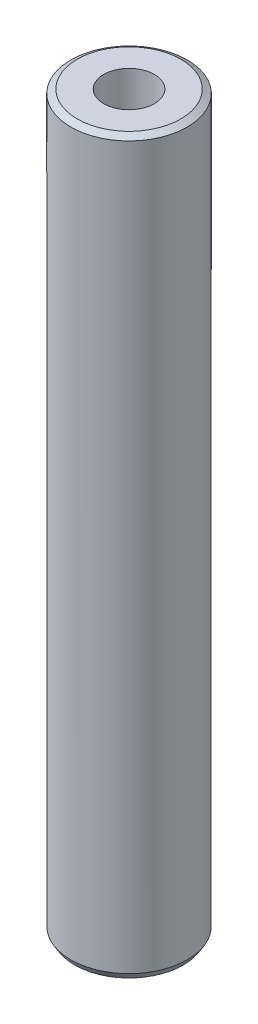
ISO-10303-21;
HEADER;
FILE_DESCRIPTION(('STEP AP214'),'2;1');
FILE_NAME('part.step','',(''),(''),'','','');
FILE_SCHEMA(('AUTOMOTIVE_DESIGN { 1 0 10303 214 1 1 1 1 }'));
ENDSEC;
DATA;
#1=APPLICATION_CONTEXT('core data for automotive mechanical design processes');
#2=APPLICATION_PROTOCOL_DEFINITION('international standard','automotive_design',2000,#1);
#3=PRODUCT_CONTEXT('',#1,'mechanical');
#4=PRODUCT('Part','Part','',(#3));
#5=PRODUCT_RELATED_PRODUCT_CATEGORY('part','',(#4));
#6=PRODUCT_DEFINITION_FORMATION('','',#4);
#7=PRODUCT_DEFINITION_CONTEXT('part definition',#1,'design');
#8=PRODUCT_DEFINITION('design','',#6,#7);
#9=PRODUCT_DEFINITION_SHAPE('','',#8);
#10=(LENGTH_UNIT() NAMED_UNIT(*) SI_UNIT(.MILLI.,.METRE.));
#11=(NAMED_UNIT(*) PLANE_ANGLE_UNIT() SI_UNIT($,.RADIAN.));
#12=(NAMED_UNIT(*) SI_UNIT($,.STERADIAN.) SOLID_ANGLE_UNIT());
#13=UNCERTAINTY_MEASURE_WITH_UNIT(LENGTH_MEASURE(1.E-05),#10,'distance_accuracy_value','');
#14=(GEOMETRIC_REPRESENTATION_CONTEXT(3) GLOBAL_UNCERTAINTY_ASSIGNED_CONTEXT((#13)) GLOBAL_UNIT_ASSIGNED_CONTEXT((#10,
#11,#12)) REPRESENTATION_CONTEXT('',''));
#15=CARTESIAN_POINT('',(0.,0.,0.));
#16=DIRECTION('',(0.,0.,1.));
#17=DIRECTION('',(1.,0.,0.));
#18=AXIS2_PLACEMENT_3D('',#15,#16,#17);
#19=CARTESIAN_POINT('',(0.,282.750199307236,0.));
#20=DIRECTION('',(0.,-1.,0.));
#21=DIRECTION('',(0.,0.,-1.));
#22=AXIS2_PLACEMENT_3D('',#19,#20,#21);
#23=CYLINDRICAL_SURFACE('',#22,22.5);
#24=CARTESIAN_POINT('',(0.,281.274876335171,0.));
#25=DIRECTION('',(0.,1.,0.));
#26=DIRECTION('',(0.,0.,1.));
#27=AXIS2_PLACEMENT_3D('',#24,#25,#26);
#28=CIRCLE('',#27,22.5);
#29=CARTESIAN_POINT('',(0.,281.274876335171,-22.5));
#30=VERTEX_POINT('',#29);
#31=EDGE_CURVE('E50',#30,#30,#28,.F.);
#32=CARTESIAN_POINT('',(0.,2.48496515971053,0.));
#33=DIRECTION('',(0.,1.,0.));
#34=DIRECTION('',(0.,0.,1.));
#35=AXIS2_PLACEMENT_3D('',#32,#33,#34);
#36=CIRCLE('',#35,22.5);
#37=CARTESIAN_POINT('',(0.,2.48496515971053,-22.5));
#38=VERTEX_POINT('',#37);
#39=EDGE_CURVE('E51',#38,#38,#36,.T.);
#40=CARTESIAN_POINT('',(0.,281.274876335171,-22.5));
#41=CARTESIAN_POINT('',(0.,278.370814760427,-22.5));
#42=CARTESIAN_POINT('',(0.,275.466753185682,-22.5));
#43=CARTESIAN_POINT('',(0.,269.658630036193,-22.5));
#44=CARTESIAN_POINT('',(0.,266.754568461449,-22.5));
#45=CARTESIAN_POINT('',(0.,260.94644531196,-22.5));
#46=CARTESIAN_POINT('',(0.,258.042383737216,-22.5));
#47=CARTESIAN_POINT('',(0.,252.234260587727,-22.5));
#48=CARTESIAN_POINT('',(0.,249.330199012983,-22.5));
#49=CARTESIAN_POINT('',(0.,243.522075863494,-22.5));
#50=CARTESIAN_POINT('',(0.,240.61801428875,-22.5));
#51=CARTESIAN_POINT('',(0.,234.809891139261,-22.5));
#52=CARTESIAN_POINT('',(0.,231.905829564517,-22.5));
#53=CARTESIAN_POINT('',(0.,226.097706415028,-22.5));
#54=CARTESIAN_POINT('',(0.,223.193644840283,-22.5));
#55=CARTESIAN_POINT('',(0.,217.385521690795,-22.5));
#56=CARTESIAN_POINT('',(0.,214.48146011605,-22.5));
#57=CARTESIAN_POINT('',(0.,208.673336966561,-22.5));
#58=CARTESIAN_POINT('',(0.,205.769275391817,-22.5));
#59=CARTESIAN_POINT('',(0.,199.961152242328,-22.5));
#60=CARTESIAN_POINT('',(0.,197.057090667584,-22.5));
#61=CARTESIAN_POINT('',(0.,191.248967518095,-22.5));
#62=CARTESIAN_POINT('',(0.,188.344905943351,-22.5));
#63=CARTESIAN_POINT('',(0.,182.536782793862,-22.5));
#64=CARTESIAN_POINT('',(0.,179.632721219118,-22.5));
#65=CARTESIAN_POINT('',(0.,173.824598069629,-22.5));
#66=CARTESIAN_POINT('',(0.,170.920536494885,-22.5));
#67=CARTESIAN_POINT('',(0.,165.112413345396,-22.5));
#68=CARTESIAN_POINT('',(0.,162.208351770651,-22.5));
#69=CARTESIAN_POINT('',(0.,156.400228621163,-22.5));
#70=CARTESIAN_POINT('',(0.,153.496167046418,-22.5));
#71=CARTESIAN_POINT('',(0.,147.68804389693,-22.5));
#72=CARTESIAN_POINT('',(0.,144.783982322185,-22.5));
#73=CARTESIAN_POINT('',(0.,138.975859172696,-22.5));
#74=CARTESIAN_POINT('',(0.,136.071797597952,-22.5));
#75=CARTESIAN_POINT('',(0.,130.263674448463,-22.5));
#76=CARTESIAN_POINT('',(0.,127.359612873719,-22.5));
#77=CARTESIAN_POINT('',(0.,121.55148972423,-22.5));
#78=CARTESIAN_POINT('',(0.,118.647428149486,-22.5));
#79=CARTESIAN_POINT('',(0.,112.839304999997,-22.5));
#80=CARTESIAN_POINT('',(0.,109.935243425253,-22.5));
#81=CARTESIAN_POINT('',(0.,104.127120275764,-22.5));
#82=CARTESIAN_POINT('',(0.,101.223058701019,-22.5));
#83=CARTESIAN_POINT('',(0.,95.4149355515307,-22.5));
#84=CARTESIAN_POINT('',(0.,92.5108739767863,-22.5));
#85=CARTESIAN_POINT('',(0.,86.7027508272975,-22.5));
#86=CARTESIAN_POINT('',(0.,83.7986892525532,-22.5));
#87=CARTESIAN_POINT('',(0.,77.9905661030644,-22.5));
#88=CARTESIAN_POINT('',(0.,75.08650452832,-22.5));
#89=CARTESIAN_POINT('',(0.,69.2783813788313,-22.5));
#90=CARTESIAN_POINT('',(0.,66.3743198040869,-22.5));
#91=CARTESIAN_POINT('',(0.,60.5661966545981,-22.5));
#92=CARTESIAN_POINT('',(0.,57.6621350798537,-22.5));
#93=CARTESIAN_POINT('',(0.,51.854011930365,-22.5));
#94=CARTESIAN_POINT('',(0.,48.9499503556206,-22.5));
#95=CARTESIAN_POINT('',(0.,43.1418272061319,-22.5));
#96=CARTESIAN_POINT('',(0.,40.2377656313875,-22.5));
#97=CARTESIAN_POINT('',(0.,34.4296424818987,-22.5));
#98=CARTESIAN_POINT('',(0.,31.5255809071543,-22.5));
#99=CARTESIAN_POINT('',(0.,25.7174577576656,-22.5));
#100=CARTESIAN_POINT('',(0.,22.8133961829212,-22.5));
#101=CARTESIAN_POINT('',(0.,17.0052730334324,-22.5));
#102=CARTESIAN_POINT('',(0.,14.101211458688,-22.5));
#103=CARTESIAN_POINT('',(0.,8.29308830919928,-22.5));
#104=CARTESIAN_POINT('',(0.,5.38902673445491,-22.5));
#105=CARTESIAN_POINT('',(0.,2.48496515971053,-22.5));
#106=B_SPLINE_CURVE_WITH_KNOTS('',3,(#40,#41,#42,#43,#44,#45,#46,#47,#48,#49,#50,#51,#52,#53,
#54,#55,#56,#57,#58,#59,#60,#61,#62,#63,#64,#65,#66,#67,#68,#69,#70,#71,#72,#73,#74,#75,#76,#77,
#78,#79,#80,#81,#82,#83,#84,#85,#86,#87,#88,#89,#90,#91,#92,#93,#94,#95,#96,#97,#98,#99,#100,
#101,#102,#103,#104,#105),.UNSPECIFIED.,.F.,.F.,(4,2,2,2,2,2,2,2,2,2,2,2,2,2,2,2,2,2,2,2,2,2,2,
2,2,2,2,2,2,2,2,2,4),(0.,8.71218472423313,17.4243694484663,26.1365541726994,34.8487388969325,
43.5609236211657,52.2731083453988,60.9852930696319,69.6974777938651,78.4096625180982,
87.1218472423314,95.8340319665645,104.546216690798,113.258401415031,121.970586139264,
130.682770863497,139.39495558773,148.107140311963,156.819325036196,165.53150976043,
174.243694484663,182.955879208896,191.668063933129,200.380248657362,209.092433381595,
217.804618105828,226.516802830062,235.228987554295,243.941172278528,252.653357002761,
261.365541726994,270.077726451227,278.78991117546),.UNSPECIFIED.);
#107=EDGE_CURVE('BSEAM39',#30,#38,#106,.T.);
#108=ORIENTED_EDGE('',*,*,#31,.T.);
#109=ORIENTED_EDGE('',*,*,#39,.T.);
#110=ORIENTED_EDGE('',*,*,#107,.T.);
#111=ORIENTED_EDGE('',*,*,#107,.F.);
#112=EDGE_LOOP('',(#108,#110,#109,#111));
#113=FACE_BOUND('',#112,.T.);
#114=ADVANCED_FACE('F39',(#113),#23,.T.);
#115=CARTESIAN_POINT('',(0.,282.750199307236,0.));
#116=DIRECTION('',(0.,1.,0.));
#117=DIRECTION('',(0.,0.,1.));
#118=AXIS2_PLACEMENT_3D('',#115,#116,#117);
#119=PLANE('',#118);
#120=CARTESIAN_POINT('',(0.,282.750199307236,0.));
#121=DIRECTION('',(0.,1.,0.));
#122=DIRECTION('',(0.,0.,1.));
#123=AXIS2_PLACEMENT_3D('',#120,#121,#122);
#124=CIRCLE('',#123,20.0150348402902);
#125=CARTESIAN_POINT('',(0.,282.750199307236,20.0150348402902));
#126=VERTEX_POINT('',#125);
#127=EDGE_CURVE('E54',#126,#126,#124,.T.);
#128=ORIENTED_EDGE('',*,*,#127,.T.);
#129=EDGE_LOOP('',(#128));
#130=FACE_BOUND('',#129,.T.);
#131=CARTESIAN_POINT('',(0.,282.750199307236,0.));
#132=DIRECTION('',(0.,1.,0.));
#133=DIRECTION('',(0.,0.,1.));
#134=AXIS2_PLACEMENT_3D('',#131,#132,#133);
#135=CIRCLE('',#134,9.8021468280561);
#136=CARTESIAN_POINT('',(0.,282.750199307236,-9.8021468280561));
#137=VERTEX_POINT('',#136);
#138=EDGE_CURVE('E58',#137,#137,#135,.T.);
#139=ORIENTED_EDGE('',*,*,#138,.F.);
#140=EDGE_LOOP('',(#139));
#141=FACE_BOUND('',#140,.T.);
#142=ADVANCED_FACE('F69',(#130,#141),#119,.T.);
#143=CARTESIAN_POINT('',(0.,0.,0.));
#144=DIRECTION('',(0.,1.,0.));
#145=DIRECTION('',(0.,0.,1.));
#146=AXIS2_PLACEMENT_3D('',#143,#144,#145);
#147=PLANE('',#146);
#148=CARTESIAN_POINT('',(0.,0.,0.));
#149=DIRECTION('',(0.,1.,0.));
#150=DIRECTION('',(0.,0.,1.));
#151=AXIS2_PLACEMENT_3D('',#148,#149,#150);
#152=CIRCLE('',#151,21.0246770279342);
#153=CARTESIAN_POINT('',(0.,0.,21.0246770279342));
#154=VERTEX_POINT('',#153);
#155=EDGE_CURVE('E10',#154,#154,#152,.F.);
#156=ORIENTED_EDGE('',*,*,#155,.T.);
#157=EDGE_LOOP('',(#156));
#158=FACE_BOUND('',#157,.T.);
#159=CARTESIAN_POINT('',(0.,0.,0.));
#160=DIRECTION('',(0.,1.,0.));
#161=DIRECTION('',(0.,0.,1.));
#162=AXIS2_PLACEMENT_3D('',#159,#160,#161);
#163=CIRCLE('',#162,9.8021468280561);
#164=CARTESIAN_POINT('',(0.,0.,-9.8021468280561));
#165=VERTEX_POINT('',#164);
#166=EDGE_CURVE('E63',#165,#165,#163,.T.);
#167=ORIENTED_EDGE('',*,*,#166,.T.);
#168=EDGE_LOOP('',(#167));
#169=FACE_BOUND('',#168,.T.);
#170=ADVANCED_FACE('F75',(#158,#169),#147,.F.);
#171=CARTESIAN_POINT('',(0.,282.750199307236,0.));
#172=DIRECTION('',(0.,-1.,0.));
#173=DIRECTION('',(0.,0.,-1.));
#174=AXIS2_PLACEMENT_3D('',#171,#172,#173);
#175=CYLINDRICAL_SURFACE('',#174,9.8021468280561);
#176=CARTESIAN_POINT('',(0.,282.750199307236,-9.8021468280561));
#177=CARTESIAN_POINT('',(0.,279.804884731119,-9.8021468280561));
#178=CARTESIAN_POINT('',(0.,276.859570155002,-9.8021468280561));
#179=CARTESIAN_POINT('',(0.,270.968941002768,-9.8021468280561));
#180=CARTESIAN_POINT('',(0.,268.023626426651,-9.8021468280561));
#181=CARTESIAN_POINT('',(0.,262.132997274417,-9.8021468280561));
#182=CARTESIAN_POINT('',(0.,259.1876826983,-9.8021468280561));
#183=CARTESIAN_POINT('',(0.,253.297053546066,-9.8021468280561));
#184=CARTESIAN_POINT('',(0.,250.351738969949,-9.8021468280561));
#185=CARTESIAN_POINT('',(0.,244.461109817715,-9.8021468280561));
#186=CARTESIAN_POINT('',(0.,241.515795241598,-9.8021468280561));
#187=CARTESIAN_POINT('',(0.,235.625166089364,-9.8021468280561));
#188=CARTESIAN_POINT('',(0.,232.679851513247,-9.8021468280561));
#189=CARTESIAN_POINT('',(0.,226.789222361012,-9.8021468280561));
#190=CARTESIAN_POINT('',(0.,223.843907784895,-9.8021468280561));
#191=CARTESIAN_POINT('',(0.,217.953278632661,-9.8021468280561));
#192=CARTESIAN_POINT('',(0.,215.007964056544,-9.8021468280561));
#193=CARTESIAN_POINT('',(0.,209.11733490431,-9.8021468280561));
#194=CARTESIAN_POINT('',(0.,206.172020328193,-9.8021468280561));
#195=CARTESIAN_POINT('',(0.,200.281391175959,-9.8021468280561));
#196=CARTESIAN_POINT('',(0.,197.336076599842,-9.8021468280561));
#197=CARTESIAN_POINT('',(0.,191.445447447608,-9.8021468280561));
#198=CARTESIAN_POINT('',(0.,188.500132871491,-9.8021468280561));
#199=CARTESIAN_POINT('',(0.,182.609503719257,-9.8021468280561));
#200=CARTESIAN_POINT('',(0.,179.66418914314,-9.8021468280561));
#201=CARTESIAN_POINT('',(0.,173.773559990906,-9.8021468280561));
#202=CARTESIAN_POINT('',(0.,170.828245414789,-9.8021468280561));
#203=CARTESIAN_POINT('',(0.,164.937616262555,-9.8021468280561));
#204=CARTESIAN_POINT('',(0.,161.992301686437,-9.8021468280561));
#205=CARTESIAN_POINT('',(0.,156.101672534203,-9.8021468280561));
#206=CARTESIAN_POINT('',(0.,153.156357958086,-9.8021468280561));
#207=CARTESIAN_POINT('',(0.,147.265728805852,-9.8021468280561));
#208=CARTESIAN_POINT('',(0.,144.320414229735,-9.8021468280561));
#209=CARTESIAN_POINT('',(0.,138.429785077501,-9.8021468280561));
#210=CARTESIAN_POINT('',(0.,135.484470501384,-9.8021468280561));
#211=CARTESIAN_POINT('',(0.,129.59384134915,-9.8021468280561));
#212=CARTESIAN_POINT('',(0.,126.648526773033,-9.8021468280561));
#213=CARTESIAN_POINT('',(0.,120.757897620799,-9.8021468280561));
#214=CARTESIAN_POINT('',(0.,117.812583044682,-9.8021468280561));
#215=CARTESIAN_POINT('',(0.,111.921953892448,-9.8021468280561));
#216=CARTESIAN_POINT('',(0.,108.976639316331,-9.8021468280561));
#217=CARTESIAN_POINT('',(0.,103.086010164097,-9.8021468280561));
#218=CARTESIAN_POINT('',(0.,100.14069558798,-9.8021468280561));
#219=CARTESIAN_POINT('',(0.,94.2500664357454,-9.8021468280561));
#220=CARTESIAN_POINT('',(0.,91.3047518596284,-9.8021468280561));
#221=CARTESIAN_POINT('',(0.,85.4141227073943,-9.8021468280561));
#222=CARTESIAN_POINT('',(0.,82.4688081312772,-9.8021468280561));
#223=CARTESIAN_POINT('',(0.,76.5781789790431,-9.8021468280561));
#224=CARTESIAN_POINT('',(0.,73.6328644029261,-9.8021468280561));
#225=CARTESIAN_POINT('',(0.,67.742235250692,-9.8021468280561));
#226=CARTESIAN_POINT('',(0.,64.796920674575,-9.8021468280561));
#227=CARTESIAN_POINT('',(0.,58.9062915223409,-9.8021468280561));
#228=CARTESIAN_POINT('',(0.,55.9609769462238,-9.8021468280561));
#229=CARTESIAN_POINT('',(0.,50.0703477939897,-9.8021468280561));
#230=CARTESIAN_POINT('',(0.,47.1250332178727,-9.8021468280561));
#231=CARTESIAN_POINT('',(0.,41.2344040656386,-9.8021468280561));
#232=CARTESIAN_POINT('',(0.,38.2890894895216,-9.8021468280561));
#233=CARTESIAN_POINT('',(0.,32.3984603372875,-9.8021468280561));
#234=CARTESIAN_POINT('',(0.,29.4531457611704,-9.8021468280561));
#235=CARTESIAN_POINT('',(0.,23.5625166089364,-9.8021468280561));
#236=CARTESIAN_POINT('',(0.,20.6172020328193,-9.8021468280561));
#237=CARTESIAN_POINT('',(0.,14.7265728805852,-9.8021468280561));
#238=CARTESIAN_POINT('',(0.,11.7812583044682,-9.8021468280561));
#239=CARTESIAN_POINT('',(0.,5.89062915223408,-9.8021468280561));
#240=CARTESIAN_POINT('',(0.,2.94531457611704,-9.8021468280561));
#241=CARTESIAN_POINT('',(0.,0.,-9.8021468280561));
#242=B_SPLINE_CURVE_WITH_KNOTS('',3,(#176,#177,#178,#179,#180,#181,#182,#183,#184,#185,#186,
#187,#188,#189,#190,#191,#192,#193,#194,#195,#196,#197,#198,#199,#200,#201,#202,#203,#204,#205,
#206,#207,#208,#209,#210,#211,#212,#213,#214,#215,#216,#217,#218,#219,#220,#221,#222,#223,#224,
#225,#226,#227,#228,#229,#230,#231,#232,#233,#234,#235,#236,#237,#238,#239,#240,#241),
.UNSPECIFIED.,.F.,.F.,(4,2,2,2,2,2,2,2,2,2,2,2,2,2,2,2,2,2,2,2,2,2,2,2,2,2,2,2,2,2,2,2,4),(0.,
8.83594372835117,17.6718874567023,26.5078311850535,35.3437749134046,44.1797186417557,
53.0156623701069,61.851606098458,70.6875498268091,79.5234935551603,88.3594372835114,
97.1953810118625,106.031324740214,114.867268468565,123.703212196916,132.539155925267,
141.375099653618,150.211043381969,159.046987110321,167.882930838672,176.718874567023,
185.554818295374,194.390762023725,203.226705752076,212.062649480427,220.898593208778,
229.73453693713,238.570480665481,247.406424393832,256.242368122183,265.078311850534,
273.914255578885,282.750199307236),.UNSPECIFIED.);
#243=EDGE_CURVE('BSEAM70',#137,#165,#242,.T.);
#244=ORIENTED_EDGE('',*,*,#138,.T.);
#245=ORIENTED_EDGE('',*,*,#166,.F.);
#246=ORIENTED_EDGE('',*,*,#243,.T.);
#247=ORIENTED_EDGE('',*,*,#243,.F.);
#248=EDGE_LOOP('',(#244,#246,#245,#247));
#249=FACE_BOUND('',#248,.T.);
#250=ADVANCED_FACE('F70',(#249),#175,.F.);
#251=CARTESIAN_POINT('',(0.,282.750199307236,0.));
#252=DIRECTION('',(0.,-1.,0.));
#253=DIRECTION('',(0.,0.,-1.));
#254=AXIS2_PLACEMENT_3D('',#251,#252,#253);
#255=CONICAL_SURFACE('',#254,20.0150348402902,1.03502230805889);
#256=ORIENTED_EDGE('',*,*,#31,.F.);
#257=EDGE_LOOP('',(#256));
#258=FACE_BOUND('',#257,.T.);
#259=ORIENTED_EDGE('',*,*,#127,.F.);
#260=EDGE_LOOP('',(#259));
#261=FACE_BOUND('',#260,.T.);
#262=ADVANCED_FACE('F81',(#258,#261),#255,.T.);
#263=CARTESIAN_POINT('',(0.,2.48496515971053,0.));
#264=DIRECTION('',(0.,1.,0.));
#265=DIRECTION('',(0.,0.,1.));
#266=AXIS2_PLACEMENT_3D('',#263,#264,#265);
#267=CONICAL_SURFACE('',#266,22.5,0.535774018736017);
#268=ORIENTED_EDGE('',*,*,#155,.F.);
#269=EDGE_LOOP('',(#268));
#270=FACE_BOUND('',#269,.T.);
#271=ORIENTED_EDGE('',*,*,#39,.F.);
#272=EDGE_LOOP('',(#271));
#273=FACE_BOUND('',#272,.T.);
#274=ADVANCED_FACE('F45',(#270,#273),#267,.T.);
#275=CLOSED_SHELL('',(#114,#142,#170,#250,#262,#274));
#276=MANIFOLD_SOLID_BREP('B2',#275);
#277=ADVANCED_BREP_SHAPE_REPRESENTATION('',(#18,#276),#14);
#278=SHAPE_DEFINITION_REPRESENTATION(#9,#277);
ENDSEC;
END-ISO-10303-21;
